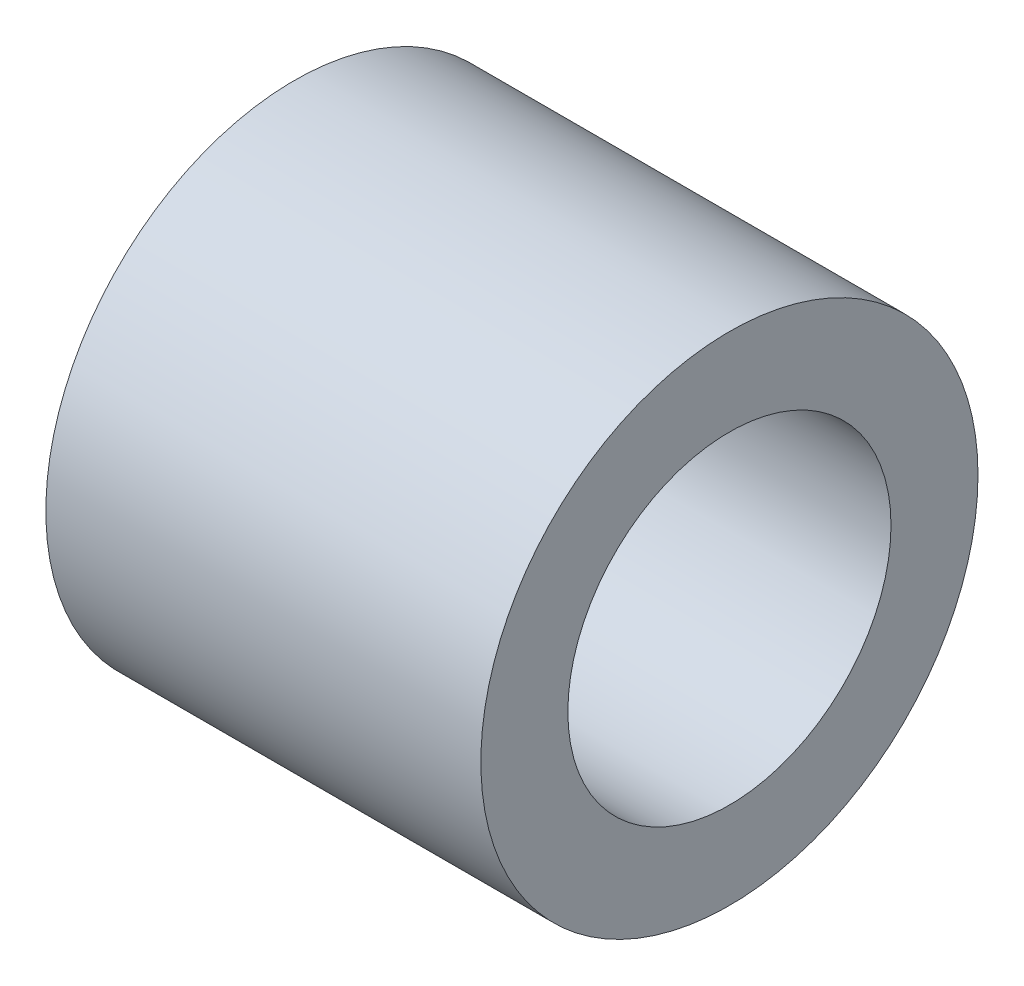
ISO-10303-21;
HEADER;
FILE_DESCRIPTION(('STEP AP214'),'2;1');
FILE_NAME('part.step','',(''),(''),'','','');
FILE_SCHEMA(('AUTOMOTIVE_DESIGN { 1 0 10303 214 1 1 1 1 }'));
ENDSEC;
DATA;
#1=APPLICATION_CONTEXT('core data for automotive mechanical design processes');
#2=APPLICATION_PROTOCOL_DEFINITION('international standard','automotive_design',2000,#1);
#3=PRODUCT_CONTEXT('',#1,'mechanical');
#4=PRODUCT('Part','Part','',(#3));
#5=PRODUCT_RELATED_PRODUCT_CATEGORY('part','',(#4));
#6=PRODUCT_DEFINITION_FORMATION('','',#4);
#7=PRODUCT_DEFINITION_CONTEXT('part definition',#1,'design');
#8=PRODUCT_DEFINITION('design','',#6,#7);
#9=PRODUCT_DEFINITION_SHAPE('','',#8);
#10=(LENGTH_UNIT() NAMED_UNIT(*) SI_UNIT(.MILLI.,.METRE.));
#11=(NAMED_UNIT(*) PLANE_ANGLE_UNIT() SI_UNIT($,.RADIAN.));
#12=(NAMED_UNIT(*) SI_UNIT($,.STERADIAN.) SOLID_ANGLE_UNIT());
#13=UNCERTAINTY_MEASURE_WITH_UNIT(LENGTH_MEASURE(1.E-05),#10,'distance_accuracy_value','');
#14=(GEOMETRIC_REPRESENTATION_CONTEXT(3) GLOBAL_UNCERTAINTY_ASSIGNED_CONTEXT((#13)) GLOBAL_UNIT_ASSIGNED_CONTEXT((#10,
#11,#12)) REPRESENTATION_CONTEXT('',''));
#15=CARTESIAN_POINT('',(0.,0.,0.));
#16=DIRECTION('',(0.,0.,1.));
#17=DIRECTION('',(1.,0.,0.));
#18=AXIS2_PLACEMENT_3D('',#15,#16,#17);
#19=CARTESIAN_POINT('',(7.,0.,0.));
#20=DIRECTION('',(1.,0.,0.));
#21=DIRECTION('',(0.,0.,-1.));
#22=AXIS2_PLACEMENT_3D('',#19,#20,#21);
#23=PLANE('',#22);
#24=CARTESIAN_POINT('',(7.,0.,0.));
#25=DIRECTION('',(1.,0.,0.));
#26=DIRECTION('',(0.,0.,-1.));
#27=AXIS2_PLACEMENT_3D('',#24,#25,#26);
#28=CIRCLE('',#27,4.);
#29=CARTESIAN_POINT('',(7.,0.,-4.));
#30=VERTEX_POINT('',#29);
#31=EDGE_CURVE('E10',#30,#30,#28,.T.);
#32=ORIENTED_EDGE('',*,*,#31,.T.);
#33=EDGE_LOOP('',(#32));
#34=FACE_BOUND('',#33,.T.);
#35=CARTESIAN_POINT('',(7.,0.,0.));
#36=DIRECTION('',(1.,0.,0.));
#37=DIRECTION('',(0.,0.,-1.));
#38=AXIS2_PLACEMENT_3D('',#35,#36,#37);
#39=CIRCLE('',#38,2.6);
#40=CARTESIAN_POINT('',(7.,0.,-2.6));
#41=VERTEX_POINT('',#40);
#42=EDGE_CURVE('E42',#41,#41,#39,.T.);
#43=ORIENTED_EDGE('',*,*,#42,.F.);
#44=EDGE_LOOP('',(#43));
#45=FACE_BOUND('',#44,.T.);
#46=ADVANCED_FACE('F31',(#34,#45),#23,.T.);
#47=CARTESIAN_POINT('',(0.,0.,0.));
#48=DIRECTION('',(1.,0.,0.));
#49=DIRECTION('',(0.,0.,-1.));
#50=AXIS2_PLACEMENT_3D('',#47,#48,#49);
#51=PLANE('',#50);
#52=CARTESIAN_POINT('',(0.,0.,0.));
#53=DIRECTION('',(1.,0.,0.));
#54=DIRECTION('',(0.,0.,-1.));
#55=AXIS2_PLACEMENT_3D('',#52,#53,#54);
#56=CIRCLE('',#55,4.);
#57=CARTESIAN_POINT('',(0.,0.,-4.));
#58=VERTEX_POINT('',#57);
#59=EDGE_CURVE('E35',#58,#58,#56,.T.);
#60=ORIENTED_EDGE('',*,*,#59,.F.);
#61=EDGE_LOOP('',(#60));
#62=FACE_BOUND('',#61,.T.);
#63=CARTESIAN_POINT('',(0.,0.,0.));
#64=DIRECTION('',(1.,0.,0.));
#65=DIRECTION('',(0.,0.,-1.));
#66=AXIS2_PLACEMENT_3D('',#63,#64,#65);
#67=CIRCLE('',#66,2.6);
#68=CARTESIAN_POINT('',(0.,0.,-2.6));
#69=VERTEX_POINT('',#68);
#70=EDGE_CURVE('E44',#69,#69,#67,.T.);
#71=ORIENTED_EDGE('',*,*,#70,.T.);
#72=EDGE_LOOP('',(#71));
#73=FACE_BOUND('',#72,.T.);
#74=ADVANCED_FACE('F54',(#62,#73),#51,.F.);
#75=CARTESIAN_POINT('',(7.,0.,0.));
#76=DIRECTION('',(-1.,0.,0.));
#77=DIRECTION('',(0.,0.,1.));
#78=AXIS2_PLACEMENT_3D('',#75,#76,#77);
#79=CYLINDRICAL_SURFACE('',#78,4.);
#80=ORIENTED_EDGE('',*,*,#31,.F.);
#81=EDGE_LOOP('',(#80));
#82=FACE_BOUND('',#81,.T.);
#83=ORIENTED_EDGE('',*,*,#59,.T.);
#84=EDGE_LOOP('',(#83));
#85=FACE_BOUND('',#84,.T.);
#86=ADVANCED_FACE('F33',(#82,#85),#79,.T.);
#87=CARTESIAN_POINT('',(7.,0.,0.));
#88=DIRECTION('',(-1.,0.,0.));
#89=DIRECTION('',(0.,0.,1.));
#90=AXIS2_PLACEMENT_3D('',#87,#88,#89);
#91=CYLINDRICAL_SURFACE('',#90,2.6);
#92=ORIENTED_EDGE('',*,*,#42,.T.);
#93=EDGE_LOOP('',(#92));
#94=FACE_BOUND('',#93,.T.);
#95=ORIENTED_EDGE('',*,*,#70,.F.);
#96=EDGE_LOOP('',(#95));
#97=FACE_BOUND('',#96,.T.);
#98=ADVANCED_FACE('F50',(#94,#97),#91,.F.);
#99=CLOSED_SHELL('',(#46,#74,#86,#98));
#100=MANIFOLD_SOLID_BREP('B2',#99);
#101=ADVANCED_BREP_SHAPE_REPRESENTATION('',(#18,#100),#14);
#102=SHAPE_DEFINITION_REPRESENTATION(#9,#101);
ENDSEC;
END-ISO-10303-21;
